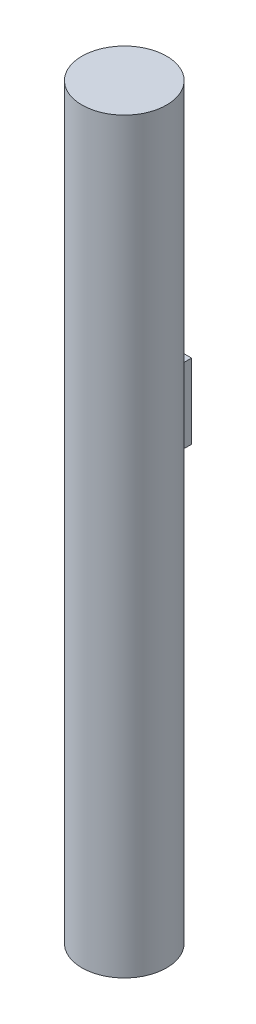
ISO-10303-21;
HEADER;
FILE_DESCRIPTION(('STEP AP214'),'2;1');
FILE_NAME('part.step','',(''),(''),'','','');
FILE_SCHEMA(('AUTOMOTIVE_DESIGN { 1 0 10303 214 1 1 1 1 }'));
ENDSEC;
DATA;
#1=APPLICATION_CONTEXT('core data for automotive mechanical design processes');
#2=APPLICATION_PROTOCOL_DEFINITION('international standard','automotive_design',2000,#1);
#3=PRODUCT_CONTEXT('',#1,'mechanical');
#4=PRODUCT('Part','Part','',(#3));
#5=PRODUCT_RELATED_PRODUCT_CATEGORY('part','',(#4));
#6=PRODUCT_DEFINITION_FORMATION('','',#4);
#7=PRODUCT_DEFINITION_CONTEXT('part definition',#1,'design');
#8=PRODUCT_DEFINITION('design','',#6,#7);
#9=PRODUCT_DEFINITION_SHAPE('','',#8);
#10=(LENGTH_UNIT() NAMED_UNIT(*) SI_UNIT(.MILLI.,.METRE.));
#11=(NAMED_UNIT(*) PLANE_ANGLE_UNIT() SI_UNIT($,.RADIAN.));
#12=(NAMED_UNIT(*) SI_UNIT($,.STERADIAN.) SOLID_ANGLE_UNIT());
#13=UNCERTAINTY_MEASURE_WITH_UNIT(LENGTH_MEASURE(1.E-05),#10,'distance_accuracy_value','');
#14=(GEOMETRIC_REPRESENTATION_CONTEXT(3) GLOBAL_UNCERTAINTY_ASSIGNED_CONTEXT((#13)) GLOBAL_UNIT_ASSIGNED_CONTEXT((#10,
#11,#12)) REPRESENTATION_CONTEXT('',''));
#15=CARTESIAN_POINT('',(0.,0.,0.));
#16=DIRECTION('',(0.,0.,1.));
#17=DIRECTION('',(1.,0.,0.));
#18=AXIS2_PLACEMENT_3D('',#15,#16,#17);
#19=CARTESIAN_POINT('',(0.,150.,0.));
#20=DIRECTION('',(0.,-1.,0.));
#21=DIRECTION('',(0.,0.,-1.));
#22=AXIS2_PLACEMENT_3D('',#19,#20,#21);
#23=CYLINDRICAL_SURFACE('',#22,8.5);
#24=DIRECTION('',(0.,-1.,0.));
#25=VECTOR('',#24,1.);
#26=CARTESIAN_POINT('',(-2.975,150.,-7.96237244795796));
#27=LINE('',#26,#25);
#28=CARTESIAN_POINT('',(-2.975,98.52,-7.96237244795796));
#29=VERTEX_POINT('',#28);
#30=CARTESIAN_POINT('',(-2.975,80.52,-7.96237244795796));
#31=VERTEX_POINT('',#30);
#32=EDGE_CURVE('E147',#29,#31,#27,.T.);
#33=ORIENTED_EDGE('',*,*,#32,.T.);
#34=CARTESIAN_POINT('',(0.,80.52,0.));
#35=DIRECTION('',(0.,1.,0.));
#36=DIRECTION('',(0.,0.,1.));
#37=AXIS2_PLACEMENT_3D('',#34,#35,#36);
#38=CIRCLE('',#37,8.5);
#39=CARTESIAN_POINT('',(2.975,80.52,-7.96237244795796));
#40=VERTEX_POINT('',#39);
#41=EDGE_CURVE('E153',#31,#40,#38,.F.);
#42=ORIENTED_EDGE('',*,*,#41,.T.);
#43=DIRECTION('',(0.,-1.,0.));
#44=VECTOR('',#43,1.);
#45=CARTESIAN_POINT('',(2.975,150.,-7.96237244795796));
#46=LINE('',#45,#44);
#47=CARTESIAN_POINT('',(2.975,98.52,-7.96237244795796));
#48=VERTEX_POINT('',#47);
#49=EDGE_CURVE('E151',#40,#48,#46,.F.);
#50=ORIENTED_EDGE('',*,*,#49,.T.);
#51=CARTESIAN_POINT('',(0.,98.52,0.));
#52=DIRECTION('',(0.,1.,0.));
#53=DIRECTION('',(0.,0.,1.));
#54=AXIS2_PLACEMENT_3D('',#51,#52,#53);
#55=CIRCLE('',#54,8.5);
#56=EDGE_CURVE('E149',#48,#29,#55,.T.);
#57=ORIENTED_EDGE('',*,*,#56,.T.);
#58=EDGE_LOOP('',(#33,#42,#50,#57));
#59=FACE_BOUND('',#58,.T.);
#60=CARTESIAN_POINT('',(0.,150.,0.));
#61=DIRECTION('',(0.,1.,0.));
#62=DIRECTION('',(0.,0.,1.));
#63=AXIS2_PLACEMENT_3D('',#60,#61,#62);
#64=CIRCLE('',#63,8.5);
#65=CARTESIAN_POINT('',(0.,150.,8.5));
#66=VERTEX_POINT('',#65);
#67=EDGE_CURVE('E139',#66,#66,#64,.T.);
#68=ORIENTED_EDGE('',*,*,#67,.F.);
#69=EDGE_LOOP('',(#68));
#70=FACE_BOUND('',#69,.T.);
#71=CARTESIAN_POINT('',(0.,0.,0.));
#72=DIRECTION('',(0.,1.,0.));
#73=DIRECTION('',(0.,0.,1.));
#74=AXIS2_PLACEMENT_3D('',#71,#72,#73);
#75=CIRCLE('',#74,8.5);
#76=CARTESIAN_POINT('',(0.,0.,8.5));
#77=VERTEX_POINT('',#76);
#78=EDGE_CURVE('E124',#77,#77,#75,.T.);
#79=ORIENTED_EDGE('',*,*,#78,.T.);
#80=EDGE_LOOP('',(#79));
#81=FACE_BOUND('',#80,.T.);
#82=ADVANCED_FACE('F33',(#59,#70,#81),#23,.T.);
#83=CARTESIAN_POINT('',(0.,150.,0.));
#84=DIRECTION('',(0.,1.,0.));
#85=DIRECTION('',(0.,0.,1.));
#86=AXIS2_PLACEMENT_3D('',#83,#84,#85);
#87=PLANE('',#86);
#88=ORIENTED_EDGE('',*,*,#67,.T.);
#89=EDGE_LOOP('',(#88));
#90=FACE_BOUND('',#89,.T.);
#91=ADVANCED_FACE('F199',(#90),#87,.T.);
#92=CARTESIAN_POINT('',(0.,0.,0.));
#93=DIRECTION('',(0.,1.,0.));
#94=DIRECTION('',(0.,0.,1.));
#95=AXIS2_PLACEMENT_3D('',#92,#93,#94);
#96=PLANE('',#95);
#97=ORIENTED_EDGE('',*,*,#78,.F.);
#98=EDGE_LOOP('',(#97));
#99=FACE_BOUND('',#98,.T.);
#100=ADVANCED_FACE('F198',(#99),#96,.F.);
#101=CARTESIAN_POINT('',(2.,97.02,0.));
#102=DIRECTION('',(-1.,0.,0.));
#103=DIRECTION('',(0.,0.,1.));
#104=AXIS2_PLACEMENT_3D('',#101,#102,#103);
#105=PLANE('',#104);
#106=DIRECTION('',(0.,0.,-1.));
#107=VECTOR('',#106,1.);
#108=CARTESIAN_POINT('',(2.,97.02,0.));
#109=LINE('',#108,#107);
#110=CARTESIAN_POINT('',(2.,97.02,-9.79795897113272));
#111=VERTEX_POINT('',#110);
#112=CARTESIAN_POINT('',(2.,97.02,-11.5));
#113=VERTEX_POINT('',#112);
#114=EDGE_CURVE('E104',#111,#113,#109,.T.);
#115=ORIENTED_EDGE('',*,*,#114,.F.);
#116=CARTESIAN_POINT('',(2.,97.02,-9.79795897113272));
#117=CARTESIAN_POINT('',(2.,97.0200520232857,-9.7248096498705));
#118=CARTESIAN_POINT('',(2.,97.0251116328593,-9.6523629970665));
#119=CARTESIAN_POINT('',(2.,97.0452459323844,-9.50887568542518));
#120=CARTESIAN_POINT('',(2.,97.0603205306146,-9.43783501371747));
#121=CARTESIAN_POINT('',(2.,97.0804026234116,-9.3674969975976));
#122=B_SPLINE_CURVE_WITH_KNOTS('',3,(#116,#117,#118,#119,#120,#121),.UNSPECIFIED.,.F.,.F.,(4,2,
4),(0.,0.217869351593706,0.435736707882741),.UNSPECIFIED.);
#123=CARTESIAN_POINT('',(2.,97.0804026234116,-9.3674969975976));
#124=VERTEX_POINT('',#123);
#125=EDGE_CURVE('E11',#111,#124,#122,.T.);
#126=ORIENTED_EDGE('',*,*,#125,.T.);
#127=DIRECTION('',(0.,1.,0.));
#128=VECTOR('',#127,1.);
#129=CARTESIAN_POINT('',(2.,82.02,-9.3674969975976));
#130=LINE('',#129,#128);
#131=CARTESIAN_POINT('',(2.,81.9595973765884,-9.3674969975976));
#132=VERTEX_POINT('',#131);
#133=EDGE_CURVE('E62',#124,#132,#130,.F.);
#134=ORIENTED_EDGE('',*,*,#133,.T.);
#135=CARTESIAN_POINT('',(2.,81.9595973765884,-9.3674969975976));
#136=CARTESIAN_POINT('',(2.,81.9796794693854,-9.43783501371747));
#137=CARTESIAN_POINT('',(2.,81.9947540676156,-9.50887568542518));
#138=CARTESIAN_POINT('',(2.,82.0148883671406,-9.6523629970665));
#139=CARTESIAN_POINT('',(2.,82.0199479767143,-9.7248096498705));
#140=CARTESIAN_POINT('',(2.,82.02,-9.79795897113271));
#141=B_SPLINE_CURVE_WITH_KNOTS('',3,(#135,#136,#137,#138,#139,#140),.UNSPECIFIED.,.F.,.F.,(4,2,
4),(0.,0.217867356289033,0.435736707882739),.UNSPECIFIED.);
#142=CARTESIAN_POINT('',(2.,82.02,-9.79795897113272));
#143=VERTEX_POINT('',#142);
#144=EDGE_CURVE('E166',#132,#143,#141,.T.);
#145=ORIENTED_EDGE('',*,*,#144,.T.);
#146=DIRECTION('',(0.,0.,-1.));
#147=VECTOR('',#146,1.);
#148=CARTESIAN_POINT('',(2.,82.02,0.));
#149=LINE('',#148,#147);
#150=CARTESIAN_POINT('',(2.,82.02,-11.5));
#151=VERTEX_POINT('',#150);
#152=EDGE_CURVE('E120',#143,#151,#149,.T.);
#153=ORIENTED_EDGE('',*,*,#152,.T.);
#154=DIRECTION('',(0.,-1.,0.));
#155=VECTOR('',#154,1.);
#156=CARTESIAN_POINT('',(2.,97.02,-11.5));
#157=LINE('',#156,#155);
#158=EDGE_CURVE('E117',#113,#151,#157,.T.);
#159=ORIENTED_EDGE('',*,*,#158,.F.);
#160=EDGE_LOOP('',(#115,#126,#134,#145,#153,#159));
#161=FACE_BOUND('',#160,.T.);
#162=ADVANCED_FACE('F118',(#161),#105,.F.);
#163=CARTESIAN_POINT('',(-2.,97.02,0.));
#164=DIRECTION('',(-1.,0.,0.));
#165=DIRECTION('',(0.,0.,1.));
#166=AXIS2_PLACEMENT_3D('',#163,#164,#165);
#167=PLANE('',#166);
#168=CARTESIAN_POINT('',(-2.,82.02,-9.79795897113272));
#169=CARTESIAN_POINT('',(-2.,82.0199479767143,-9.7248096498705));
#170=CARTESIAN_POINT('',(-2.,82.0148883671406,-9.6523629970665));
#171=CARTESIAN_POINT('',(-2.,81.9947540676156,-9.50887568542518));
#172=CARTESIAN_POINT('',(-2.,81.9796794693854,-9.43783501371747));
#173=CARTESIAN_POINT('',(-2.,81.9595973765884,-9.3674969975976));
#174=B_SPLINE_CURVE_WITH_KNOTS('',3,(#168,#169,#170,#171,#172,#173),.UNSPECIFIED.,.F.,.F.,(4,2,
4),(0.,0.217869351593706,0.435736707882741),.UNSPECIFIED.);
#175=CARTESIAN_POINT('',(-2.,82.02,-9.79795897113272));
#176=VERTEX_POINT('',#175);
#177=CARTESIAN_POINT('',(-2.,81.9595973765884,-9.3674969975976));
#178=VERTEX_POINT('',#177);
#179=EDGE_CURVE('E159',#176,#178,#174,.T.);
#180=ORIENTED_EDGE('',*,*,#179,.T.);
#181=DIRECTION('',(0.,-1.,0.));
#182=VECTOR('',#181,1.);
#183=CARTESIAN_POINT('',(-2.,97.02,-9.3674969975976));
#184=LINE('',#183,#182);
#185=CARTESIAN_POINT('',(-2.,97.0804026234116,-9.3674969975976));
#186=VERTEX_POINT('',#185);
#187=EDGE_CURVE('E54',#178,#186,#184,.F.);
#188=ORIENTED_EDGE('',*,*,#187,.T.);
#189=CARTESIAN_POINT('',(-2.,97.0804026234116,-9.3674969975976));
#190=CARTESIAN_POINT('',(-2.,97.0603205306146,-9.43783501371747));
#191=CARTESIAN_POINT('',(-2.,97.0452459323844,-9.50887568542518));
#192=CARTESIAN_POINT('',(-2.,97.0251116328593,-9.6523629970665));
#193=CARTESIAN_POINT('',(-2.,97.0200520232857,-9.7248096498705));
#194=CARTESIAN_POINT('',(-2.,97.02,-9.79795897113271));
#195=B_SPLINE_CURVE_WITH_KNOTS('',3,(#189,#190,#191,#192,#193,#194),.UNSPECIFIED.,.F.,.F.,(4,2,
4),(0.,0.217867356289033,0.435736707882739),.UNSPECIFIED.);
#196=CARTESIAN_POINT('',(-2.,97.02,-9.79795897113272));
#197=VERTEX_POINT('',#196);
#198=EDGE_CURVE('E46',#186,#197,#195,.T.);
#199=ORIENTED_EDGE('',*,*,#198,.T.);
#200=DIRECTION('',(0.,0.,-1.));
#201=VECTOR('',#200,1.);
#202=CARTESIAN_POINT('',(-2.,97.02,0.));
#203=LINE('',#202,#201);
#204=CARTESIAN_POINT('',(-2.,97.02,-11.5));
#205=VERTEX_POINT('',#204);
#206=EDGE_CURVE('E130',#197,#205,#203,.T.);
#207=ORIENTED_EDGE('',*,*,#206,.T.);
#208=DIRECTION('',(0.,-1.,0.));
#209=VECTOR('',#208,1.);
#210=CARTESIAN_POINT('',(-2.,97.02,-11.5));
#211=LINE('',#210,#209);
#212=CARTESIAN_POINT('',(-2.,82.02,-11.5));
#213=VERTEX_POINT('',#212);
#214=EDGE_CURVE('E125',#205,#213,#211,.T.);
#215=ORIENTED_EDGE('',*,*,#214,.T.);
#216=DIRECTION('',(0.,0.,-1.));
#217=VECTOR('',#216,1.);
#218=CARTESIAN_POINT('',(-2.,82.02,0.));
#219=LINE('',#218,#217);
#220=EDGE_CURVE('E114',#176,#213,#219,.T.);
#221=ORIENTED_EDGE('',*,*,#220,.F.);
#222=EDGE_LOOP('',(#180,#188,#199,#207,#215,#221));
#223=FACE_BOUND('',#222,.T.);
#224=ADVANCED_FACE('F175',(#223),#167,.T.);
#225=CARTESIAN_POINT('',(-2.,97.02,-11.5));
#226=DIRECTION('',(0.,0.,-1.));
#227=DIRECTION('',(-1.,0.,0.));
#228=AXIS2_PLACEMENT_3D('',#225,#226,#227);
#229=PLANE('',#228);
#230=DIRECTION('',(1.,0.,0.));
#231=VECTOR('',#230,1.);
#232=CARTESIAN_POINT('',(-2.,82.02,-11.5));
#233=LINE('',#232,#231);
#234=EDGE_CURVE('E135',#213,#151,#233,.T.);
#235=ORIENTED_EDGE('',*,*,#234,.F.);
#236=ORIENTED_EDGE('',*,*,#214,.F.);
#237=DIRECTION('',(1.,0.,0.));
#238=VECTOR('',#237,1.);
#239=CARTESIAN_POINT('',(-2.,97.02,-11.5));
#240=LINE('',#239,#238);
#241=EDGE_CURVE('E109',#205,#113,#240,.T.);
#242=ORIENTED_EDGE('',*,*,#241,.T.);
#243=ORIENTED_EDGE('',*,*,#158,.T.);
#244=EDGE_LOOP('',(#235,#236,#242,#243));
#245=FACE_BOUND('',#244,.T.);
#246=ADVANCED_FACE('F128',(#245),#229,.T.);
#247=CARTESIAN_POINT('',(0.,97.02,0.));
#248=DIRECTION('',(0.,1.,0.));
#249=DIRECTION('',(0.,0.,1.));
#250=AXIS2_PLACEMENT_3D('',#247,#248,#249);
#251=PLANE('',#250);
#252=ORIENTED_EDGE('',*,*,#206,.F.);
#253=CARTESIAN_POINT('',(0.,97.02,0.));
#254=DIRECTION('',(0.,1.,0.));
#255=DIRECTION('',(0.,0.,1.));
#256=AXIS2_PLACEMENT_3D('',#253,#254,#255);
#257=CIRCLE('',#256,10.);
#258=EDGE_CURVE('E111',#197,#111,#257,.F.);
#259=ORIENTED_EDGE('',*,*,#258,.T.);
#260=ORIENTED_EDGE('',*,*,#114,.T.);
#261=ORIENTED_EDGE('',*,*,#241,.F.);
#262=EDGE_LOOP('',(#252,#259,#260,#261));
#263=FACE_BOUND('',#262,.T.);
#264=ADVANCED_FACE('F107',(#263),#251,.T.);
#265=CARTESIAN_POINT('',(0.,82.02,0.));
#266=DIRECTION('',(0.,1.,0.));
#267=DIRECTION('',(0.,0.,1.));
#268=AXIS2_PLACEMENT_3D('',#265,#266,#267);
#269=PLANE('',#268);
#270=ORIENTED_EDGE('',*,*,#152,.F.);
#271=CARTESIAN_POINT('',(0.,82.02,0.));
#272=DIRECTION('',(0.,1.,0.));
#273=DIRECTION('',(0.,0.,1.));
#274=AXIS2_PLACEMENT_3D('',#271,#272,#273);
#275=CIRCLE('',#274,10.);
#276=EDGE_CURVE('E142',#143,#176,#275,.T.);
#277=ORIENTED_EDGE('',*,*,#276,.T.);
#278=ORIENTED_EDGE('',*,*,#220,.T.);
#279=ORIENTED_EDGE('',*,*,#234,.T.);
#280=EDGE_LOOP('',(#270,#277,#278,#279));
#281=FACE_BOUND('',#280,.T.);
#282=ADVANCED_FACE('F180',(#281),#269,.F.);
#283=CARTESIAN_POINT('',(0.,98.52,0.));
#284=DIRECTION('',(0.,1.,0.));
#285=DIRECTION('',(0.,0.,1.));
#286=AXIS2_PLACEMENT_3D('',#283,#284,#285);
#287=TOROIDAL_SURFACE('',#286,10.,1.5);
#288=CARTESIAN_POINT('',(-2.,97.0804026234116,-9.3674969975976));
#289=CARTESIAN_POINT('',(-1.99999601262434,97.0917256539561,-9.32792127762486));
#290=CARTESIAN_POINT('',(-2.00156616728472,97.1045214594714,-9.28881473261201));
#291=CARTESIAN_POINT('',(-2.00759751406889,97.132742648549,-9.21187575669461));
#292=CARTESIAN_POINT('',(-2.01205290627471,97.1481627110737,-9.17404092952826));
#293=CARTESIAN_POINT('',(-2.02922299589425,97.1975341614045,-9.06367302995148));
#294=CARTESIAN_POINT('',(-2.04575550942694,97.2349057730572,-8.99323904115411));
#295=CARTESIAN_POINT('',(-2.09229396857074,97.327026165935,-8.84199160726472));
#296=CARTESIAN_POINT('',(-2.12467137495191,97.3837722470177,-8.76316660493492));
#297=CARTESIAN_POINT('',(-2.19912488749126,97.5049424615645,-8.61612318717885));
#298=CARTESIAN_POINT('',(-2.24126012295807,97.5694121991189,-8.54797386417596));
#299=CARTESIAN_POINT('',(-2.32016532479783,97.6849031802897,-8.43950467842585));
#300=CARTESIAN_POINT('',(-2.35524562463868,97.7347736182613,-8.39667399405598));
#301=CARTESIAN_POINT('',(-2.42857020051124,97.8364400650947,-8.31630919464685));
#302=CARTESIAN_POINT('',(-2.46681589690091,97.8882369325695,-8.27877747799205));
#303=CARTESIAN_POINT('',(-2.58540381800767,98.0454706557218,-8.17390486072244));
#304=CARTESIAN_POINT('',(-2.66975261308748,98.1529768981442,-8.1140813186802));
#305=CARTESIAN_POINT('',(-2.82648299009466,98.3453653247605,-8.02490926590421));
#306=CARTESIAN_POINT('',(-2.89724043334215,98.4298491617788,-7.99172629307007));
#307=CARTESIAN_POINT('',(-2.97172216463666,98.5162033855094,-7.96360043236533));
#308=CARTESIAN_POINT('',(-2.97336055698985,98.5181017033354,-7.9629850066289));
#309=CARTESIAN_POINT('',(-2.975,98.52,-7.96237244795796));
#310=B_SPLINE_CURVE_WITH_KNOTS('',3,(#288,#289,#290,#291,#292,#293,#294,#295,#296,#297,#298,
#299,#300,#301,#302,#303,#304,#305,#306,#307,#308,#309),.UNSPECIFIED.,.F.,.F.,(4,2,2,2,2,2,2,2,
2,2,4),(0.,0.123357885675907,0.246468563293471,0.489495927664664,0.795017716505438,
1.10244169227613,1.32569387568237,1.54904678431617,1.99473612560298,2.33935076845428,
2.34709674059739),.UNSPECIFIED.);
#311=EDGE_CURVE('E215',#29,#186,#310,.F.);
#312=ORIENTED_EDGE('',*,*,#311,.F.);
#313=ORIENTED_EDGE('',*,*,#56,.F.);
#314=CARTESIAN_POINT('',(2.,97.0804026234116,-9.3674969975976));
#315=CARTESIAN_POINT('',(1.99999601262434,97.0917256539561,-9.32792127762486));
#316=CARTESIAN_POINT('',(2.00156616728472,97.1045214594714,-9.28881473261201));
#317=CARTESIAN_POINT('',(2.00759751406889,97.132742648549,-9.21187575669461));
#318=CARTESIAN_POINT('',(2.01205290627471,97.1481627110737,-9.17404092952826));
#319=CARTESIAN_POINT('',(2.02922299589425,97.1975341614045,-9.06367302995148));
#320=CARTESIAN_POINT('',(2.04575550942694,97.2349057730572,-8.99323904115411));
#321=CARTESIAN_POINT('',(2.09229396857074,97.327026165935,-8.84199160726472));
#322=CARTESIAN_POINT('',(2.12467137495191,97.3837722470177,-8.76316660493492));
#323=CARTESIAN_POINT('',(2.19912488749126,97.5049424615645,-8.61612318717885));
#324=CARTESIAN_POINT('',(2.24126012295807,97.5694121991189,-8.54797386417596));
#325=CARTESIAN_POINT('',(2.32016532479783,97.6849031802897,-8.43950467842585));
#326=CARTESIAN_POINT('',(2.35524562463868,97.7347736182613,-8.39667399405598));
#327=CARTESIAN_POINT('',(2.42857020051124,97.8364400650947,-8.31630919464685));
#328=CARTESIAN_POINT('',(2.46681589690091,97.8882369325695,-8.27877747799205));
#329=CARTESIAN_POINT('',(2.58540381800767,98.0454706557218,-8.17390486072244));
#330=CARTESIAN_POINT('',(2.66975261308748,98.1529768981442,-8.1140813186802));
#331=CARTESIAN_POINT('',(2.82648299009466,98.3453653247605,-8.02490926590421));
#332=CARTESIAN_POINT('',(2.89724043334215,98.4298491617788,-7.99172629307007));
#333=CARTESIAN_POINT('',(2.97172216463666,98.5162033855094,-7.96360043236533));
#334=CARTESIAN_POINT('',(2.97336055698985,98.5181017033354,-7.9629850066289));
#335=CARTESIAN_POINT('',(2.975,98.52,-7.96237244795796));
#336=B_SPLINE_CURVE_WITH_KNOTS('',3,(#314,#315,#316,#317,#318,#319,#320,#321,#322,#323,#324,
#325,#326,#327,#328,#329,#330,#331,#332,#333,#334,#335),.UNSPECIFIED.,.F.,.F.,(4,2,2,2,2,2,2,2,
2,2,4),(0.,0.123357885675907,0.246468563293471,0.489495927664664,0.795017716505438,
1.10244169227613,1.32569387568237,1.54904678431617,1.99473612560298,2.33935076845428,
2.34709674059739),.UNSPECIFIED.);
#337=EDGE_CURVE('E38',#124,#48,#336,.T.);
#338=ORIENTED_EDGE('',*,*,#337,.F.);
#339=ORIENTED_EDGE('',*,*,#125,.F.);
#340=ORIENTED_EDGE('',*,*,#258,.F.);
#341=ORIENTED_EDGE('',*,*,#198,.F.);
#342=EDGE_LOOP('',(#312,#313,#338,#339,#340,#341));
#343=FACE_BOUND('',#342,.T.);
#344=ADVANCED_FACE('F35',(#343),#287,.F.);
#345=CARTESIAN_POINT('',(3.5,150.,-9.3674969975976));
#346=DIRECTION('',(0.,-1.,0.));
#347=DIRECTION('',(0.,0.,-1.));
#348=AXIS2_PLACEMENT_3D('',#345,#346,#347);
#349=CYLINDRICAL_SURFACE('',#348,1.5);
#350=ORIENTED_EDGE('',*,*,#337,.T.);
#351=ORIENTED_EDGE('',*,*,#49,.F.);
#352=CARTESIAN_POINT('',(2.,81.9595973765884,-9.3674969975976));
#353=CARTESIAN_POINT('',(1.99999601262434,81.9482743460439,-9.32792127762485));
#354=CARTESIAN_POINT('',(2.00156616728472,81.9354785405286,-9.28881473261201));
#355=CARTESIAN_POINT('',(2.00759751406889,81.907257351451,-9.21187575669461));
#356=CARTESIAN_POINT('',(2.01205290627471,81.8918372889263,-9.17404092952826));
#357=CARTESIAN_POINT('',(2.02922299589425,81.8424658385955,-9.06367302995148));
#358=CARTESIAN_POINT('',(2.04575550942694,81.8050942269428,-8.99323904115411));
#359=CARTESIAN_POINT('',(2.09229396857074,81.712973834065,-8.84199160726472));
#360=CARTESIAN_POINT('',(2.12467137495191,81.6562277529823,-8.76316660493492));
#361=CARTESIAN_POINT('',(2.19912488749126,81.5350575384355,-8.61612318717885));
#362=CARTESIAN_POINT('',(2.24126012295807,81.4705878008811,-8.54797386417596));
#363=CARTESIAN_POINT('',(2.32016532479783,81.3550968197103,-8.43950467842585));
#364=CARTESIAN_POINT('',(2.35524562463868,81.3052263817387,-8.39667399405598));
#365=CARTESIAN_POINT('',(2.42857020051124,81.2035599349053,-8.31630919464685));
#366=CARTESIAN_POINT('',(2.46681589690091,81.1517630674305,-8.27877747799205));
#367=CARTESIAN_POINT('',(2.58540381800767,80.9945293442782,-8.17390486072244));
#368=CARTESIAN_POINT('',(2.66975261308748,80.8870231018558,-8.1140813186802));
#369=CARTESIAN_POINT('',(2.82648299009466,80.6946346752395,-8.02490926590421));
#370=CARTESIAN_POINT('',(2.89724043334215,80.6101508382211,-7.99172629307007));
#371=CARTESIAN_POINT('',(2.97172216463666,80.5237966144905,-7.96360043236533));
#372=CARTESIAN_POINT('',(2.97336055698985,80.5218982966646,-7.9629850066289));
#373=CARTESIAN_POINT('',(2.975,80.52,-7.96237244795796));
#374=B_SPLINE_CURVE_WITH_KNOTS('',3,(#352,#353,#354,#355,#356,#357,#358,#359,#360,#361,#362,
#363,#364,#365,#366,#367,#368,#369,#370,#371,#372,#373),.UNSPECIFIED.,.F.,.F.,(4,2,2,2,2,2,2,2,
2,2,4),(0.,0.123357885675909,0.246468563293467,0.489495927664664,0.795017716505438,
1.10244169227613,1.32569387568237,1.54904678431617,1.99473612560298,2.33935076845428,
2.34709674059739),.UNSPECIFIED.);
#375=EDGE_CURVE('E220',#132,#40,#374,.T.);
#376=ORIENTED_EDGE('',*,*,#375,.F.);
#377=ORIENTED_EDGE('',*,*,#133,.F.);
#378=EDGE_LOOP('',(#350,#351,#376,#377));
#379=FACE_BOUND('',#378,.T.);
#380=ADVANCED_FACE('F212',(#379),#349,.F.);
#381=CARTESIAN_POINT('',(-3.5,150.,-9.3674969975976));
#382=DIRECTION('',(0.,-1.,0.));
#383=DIRECTION('',(0.,0.,-1.));
#384=AXIS2_PLACEMENT_3D('',#381,#382,#383);
#385=CYLINDRICAL_SURFACE('',#384,1.5);
#386=ORIENTED_EDGE('',*,*,#187,.F.);
#387=CARTESIAN_POINT('',(-2.,81.9595973765884,-9.3674969975976));
#388=CARTESIAN_POINT('',(-1.99999601262434,81.9482743460439,-9.32792127762485));
#389=CARTESIAN_POINT('',(-2.00156616728472,81.9354785405286,-9.28881473261201));
#390=CARTESIAN_POINT('',(-2.00759751406889,81.907257351451,-9.21187575669461));
#391=CARTESIAN_POINT('',(-2.01205290627471,81.8918372889263,-9.17404092952826));
#392=CARTESIAN_POINT('',(-2.02922299589425,81.8424658385955,-9.06367302995148));
#393=CARTESIAN_POINT('',(-2.04575550942694,81.8050942269428,-8.99323904115411));
#394=CARTESIAN_POINT('',(-2.09229396857074,81.712973834065,-8.84199160726472));
#395=CARTESIAN_POINT('',(-2.12467137495191,81.6562277529823,-8.76316660493492));
#396=CARTESIAN_POINT('',(-2.19912488749126,81.5350575384355,-8.61612318717885));
#397=CARTESIAN_POINT('',(-2.24126012295807,81.4705878008811,-8.54797386417596));
#398=CARTESIAN_POINT('',(-2.32016532479783,81.3550968197103,-8.43950467842585));
#399=CARTESIAN_POINT('',(-2.35524562463868,81.3052263817387,-8.39667399405598));
#400=CARTESIAN_POINT('',(-2.42857020051124,81.2035599349053,-8.31630919464685));
#401=CARTESIAN_POINT('',(-2.46681589690091,81.1517630674305,-8.27877747799205));
#402=CARTESIAN_POINT('',(-2.58540381800767,80.9945293442782,-8.17390486072244));
#403=CARTESIAN_POINT('',(-2.66975261308748,80.8870231018558,-8.1140813186802));
#404=CARTESIAN_POINT('',(-2.82648299009466,80.6946346752395,-8.02490926590421));
#405=CARTESIAN_POINT('',(-2.89724043334215,80.6101508382211,-7.99172629307007));
#406=CARTESIAN_POINT('',(-2.97172216463666,80.5237966144905,-7.96360043236533));
#407=CARTESIAN_POINT('',(-2.97336055698985,80.5218982966646,-7.9629850066289));
#408=CARTESIAN_POINT('',(-2.975,80.52,-7.96237244795796));
#409=B_SPLINE_CURVE_WITH_KNOTS('',3,(#387,#388,#389,#390,#391,#392,#393,#394,#395,#396,#397,
#398,#399,#400,#401,#402,#403,#404,#405,#406,#407,#408),.UNSPECIFIED.,.F.,.F.,(4,2,2,2,2,2,2,2,
2,2,4),(0.,0.123357885675909,0.246468563293467,0.489495927664664,0.795017716505438,
1.10244169227613,1.32569387568237,1.54904678431617,1.99473612560298,2.33935076845428,
2.34709674059739),.UNSPECIFIED.);
#410=EDGE_CURVE('E190',#31,#178,#409,.F.);
#411=ORIENTED_EDGE('',*,*,#410,.F.);
#412=ORIENTED_EDGE('',*,*,#32,.F.);
#413=ORIENTED_EDGE('',*,*,#311,.T.);
#414=EDGE_LOOP('',(#386,#411,#412,#413));
#415=FACE_BOUND('',#414,.T.);
#416=ADVANCED_FACE('F209',(#415),#385,.F.);
#417=CARTESIAN_POINT('',(0.,80.52,0.));
#418=DIRECTION('',(0.,1.,0.));
#419=DIRECTION('',(0.,0.,1.));
#420=AXIS2_PLACEMENT_3D('',#417,#418,#419);
#421=TOROIDAL_SURFACE('',#420,10.,1.5);
#422=ORIENTED_EDGE('',*,*,#375,.T.);
#423=ORIENTED_EDGE('',*,*,#41,.F.);
#424=ORIENTED_EDGE('',*,*,#410,.T.);
#425=ORIENTED_EDGE('',*,*,#179,.F.);
#426=ORIENTED_EDGE('',*,*,#276,.F.);
#427=ORIENTED_EDGE('',*,*,#144,.F.);
#428=EDGE_LOOP('',(#422,#423,#424,#425,#426,#427));
#429=FACE_BOUND('',#428,.T.);
#430=ADVANCED_FACE('F172',(#429),#421,.F.);
#431=CLOSED_SHELL('',(#82,#91,#100,#162,#224,#246,#264,#282,#344,#380,#416,#430));
#432=MANIFOLD_SOLID_BREP('B2',#431);
#433=ADVANCED_BREP_SHAPE_REPRESENTATION('',(#18,#432),#14);
#434=SHAPE_DEFINITION_REPRESENTATION(#9,#433);
ENDSEC;
END-ISO-10303-21;
